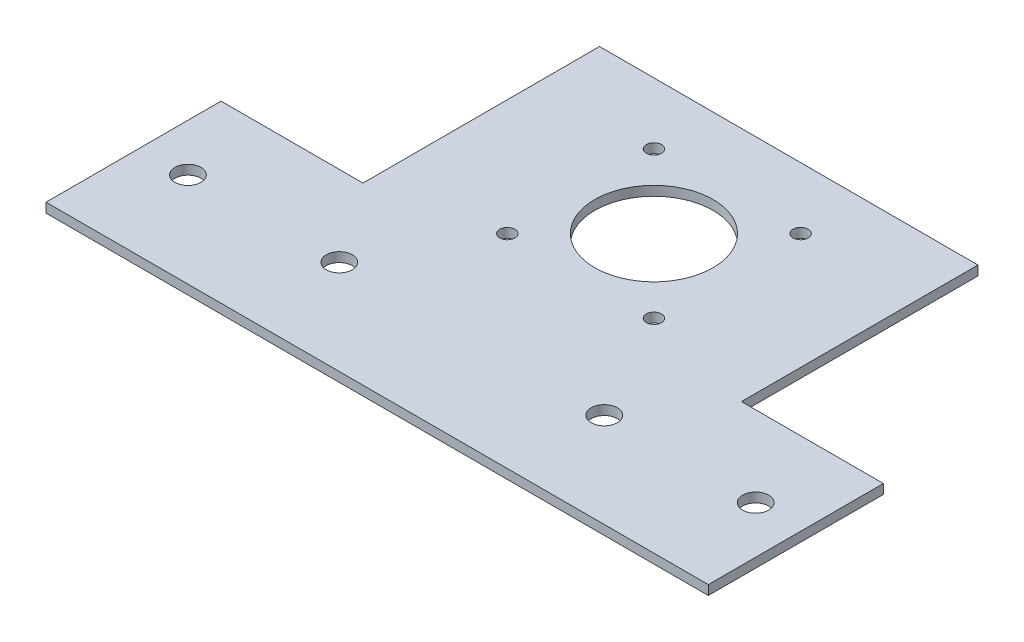
ISO-10303-21;
HEADER;
FILE_DESCRIPTION(('STEP AP214'),'2;1');
FILE_NAME('part.step','',(''),(''),'','','');
FILE_SCHEMA(('AUTOMOTIVE_DESIGN { 1 0 10303 214 1 1 1 1 }'));
ENDSEC;
DATA;
#1=APPLICATION_CONTEXT('core data for automotive mechanical design processes');
#2=APPLICATION_PROTOCOL_DEFINITION('international standard','automotive_design',2000,#1);
#3=PRODUCT_CONTEXT('',#1,'mechanical');
#4=PRODUCT('Part','Part','',(#3));
#5=PRODUCT_RELATED_PRODUCT_CATEGORY('part','',(#4));
#6=PRODUCT_DEFINITION_FORMATION('','',#4);
#7=PRODUCT_DEFINITION_CONTEXT('part definition',#1,'design');
#8=PRODUCT_DEFINITION('design','',#6,#7);
#9=PRODUCT_DEFINITION_SHAPE('','',#8);
#10=(LENGTH_UNIT() NAMED_UNIT(*) SI_UNIT(.MILLI.,.METRE.));
#11=(NAMED_UNIT(*) PLANE_ANGLE_UNIT() SI_UNIT($,.RADIAN.));
#12=(NAMED_UNIT(*) SI_UNIT($,.STERADIAN.) SOLID_ANGLE_UNIT());
#13=UNCERTAINTY_MEASURE_WITH_UNIT(LENGTH_MEASURE(1.E-05),#10,'distance_accuracy_value','');
#14=(GEOMETRIC_REPRESENTATION_CONTEXT(3) GLOBAL_UNCERTAINTY_ASSIGNED_CONTEXT((#13)) GLOBAL_UNIT_ASSIGNED_CONTEXT((#10,
#11,#12)) REPRESENTATION_CONTEXT('',''));
#15=CARTESIAN_POINT('',(0.,0.,0.));
#16=DIRECTION('',(0.,0.,1.));
#17=DIRECTION('',(1.,0.,0.));
#18=AXIS2_PLACEMENT_3D('',#15,#16,#17);
#19=CARTESIAN_POINT('',(0.,2.,0.));
#20=DIRECTION('',(0.,1.,0.));
#21=DIRECTION('',(0.,0.,1.));
#22=AXIS2_PLACEMENT_3D('',#19,#20,#21);
#23=PLANE('',#22);
#24=DIRECTION('',(0.,0.,-1.));
#25=VECTOR('',#24,1.);
#26=CARTESIAN_POINT('',(-40.,2.,-43.5));
#27=LINE('',#26,#25);
#28=CARTESIAN_POINT('',(-40.,2.,6.50000000000001));
#29=VERTEX_POINT('',#28);
#30=CARTESIAN_POINT('',(-40.,2.,-43.5));
#31=VERTEX_POINT('',#30);
#32=EDGE_CURVE('E111',#29,#31,#27,.T.);
#33=ORIENTED_EDGE('',*,*,#32,.F.);
#34=DIRECTION('',(1.,0.,0.));
#35=VECTOR('',#34,1.);
#36=CARTESIAN_POINT('',(-70.,2.,6.50000000000001));
#37=LINE('',#36,#35);
#38=CARTESIAN_POINT('',(-70.,2.,6.50000000000001));
#39=VERTEX_POINT('',#38);
#40=EDGE_CURVE('E100',#39,#29,#37,.T.);
#41=ORIENTED_EDGE('',*,*,#40,.F.);
#42=DIRECTION('',(0.,0.,1.));
#43=VECTOR('',#42,1.);
#44=CARTESIAN_POINT('',(-70.,2.,-43.5));
#45=LINE('',#44,#43);
#46=CARTESIAN_POINT('',(-70.,2.,43.5));
#47=VERTEX_POINT('',#46);
#48=EDGE_CURVE('E108',#39,#47,#45,.T.);
#49=ORIENTED_EDGE('',*,*,#48,.T.);
#50=DIRECTION('',(1.,0.,0.));
#51=VECTOR('',#50,1.);
#52=CARTESIAN_POINT('',(-70.,2.,43.5));
#53=LINE('',#52,#51);
#54=CARTESIAN_POINT('',(70.,2.,43.5));
#55=VERTEX_POINT('',#54);
#56=EDGE_CURVE('E117',#47,#55,#53,.T.);
#57=ORIENTED_EDGE('',*,*,#56,.T.);
#58=DIRECTION('',(0.,0.,-1.));
#59=VECTOR('',#58,1.);
#60=CARTESIAN_POINT('',(70.,2.,-43.5));
#61=LINE('',#60,#59);
#62=CARTESIAN_POINT('',(70.,2.,6.5));
#63=VERTEX_POINT('',#62);
#64=EDGE_CURVE('E122',#55,#63,#61,.T.);
#65=ORIENTED_EDGE('',*,*,#64,.T.);
#66=DIRECTION('',(1.,0.,0.));
#67=VECTOR('',#66,1.);
#68=CARTESIAN_POINT('',(70.,2.,6.5));
#69=LINE('',#68,#67);
#70=CARTESIAN_POINT('',(40.,2.,6.5));
#71=VERTEX_POINT('',#70);
#72=EDGE_CURVE('E217',#71,#63,#69,.T.);
#73=ORIENTED_EDGE('',*,*,#72,.F.);
#74=DIRECTION('',(0.,0.,1.));
#75=VECTOR('',#74,1.);
#76=CARTESIAN_POINT('',(40.,2.,-43.5));
#77=LINE('',#76,#75);
#78=CARTESIAN_POINT('',(40.,2.,-43.5));
#79=VERTEX_POINT('',#78);
#80=EDGE_CURVE('E220',#79,#71,#77,.T.);
#81=ORIENTED_EDGE('',*,*,#80,.F.);
#82=DIRECTION('',(-1.,0.,0.));
#83=VECTOR('',#82,1.);
#84=CARTESIAN_POINT('',(-70.,2.,-43.5));
#85=LINE('',#84,#83);
#86=EDGE_CURVE('E118',#79,#31,#85,.T.);
#87=ORIENTED_EDGE('',*,*,#86,.T.);
#88=EDGE_LOOP('',(#33,#41,#49,#57,#65,#73,#81,#87));
#89=FACE_BOUND('',#88,.T.);
#90=CARTESIAN_POINT('',(15.5000000000003,2.,0.499999999999667));
#91=DIRECTION('',(0.,1.,0.));
#92=DIRECTION('',(0.,0.,1.));
#93=AXIS2_PLACEMENT_3D('',#90,#91,#92);
#94=CIRCLE('',#93,1.6);
#95=CARTESIAN_POINT('',(15.5000000000003,2.,2.09999999999967));
#96=VERTEX_POINT('',#95);
#97=EDGE_CURVE('E194',#96,#96,#94,.T.);
#98=ORIENTED_EDGE('',*,*,#97,.F.);
#99=EDGE_LOOP('',(#98));
#100=FACE_BOUND('',#99,.T.);
#101=CARTESIAN_POINT('',(-15.5,2.,-30.5));
#102=DIRECTION('',(0.,1.,0.));
#103=DIRECTION('',(0.,0.,1.));
#104=AXIS2_PLACEMENT_3D('',#101,#102,#103);
#105=CIRCLE('',#104,1.6);
#106=CARTESIAN_POINT('',(-15.5,2.,-28.9));
#107=VERTEX_POINT('',#106);
#108=EDGE_CURVE('E182',#107,#107,#105,.T.);
#109=ORIENTED_EDGE('',*,*,#108,.F.);
#110=EDGE_LOOP('',(#109));
#111=FACE_BOUND('',#110,.T.);
#112=CARTESIAN_POINT('',(28.,2.,23.5));
#113=DIRECTION('',(0.,1.,0.));
#114=DIRECTION('',(0.,0.,1.));
#115=AXIS2_PLACEMENT_3D('',#112,#113,#114);
#116=CIRCLE('',#115,2.74999999999999);
#117=CARTESIAN_POINT('',(28.,2.,26.25));
#118=VERTEX_POINT('',#117);
#119=EDGE_CURVE('E170',#118,#118,#116,.T.);
#120=ORIENTED_EDGE('',*,*,#119,.F.);
#121=EDGE_LOOP('',(#120));
#122=FACE_BOUND('',#121,.T.);
#123=CARTESIAN_POINT('',(0.,2.,-15.));
#124=DIRECTION('',(0.,1.,0.));
#125=DIRECTION('',(0.,0.,1.));
#126=AXIS2_PLACEMENT_3D('',#123,#124,#125);
#127=CIRCLE('',#126,12.5);
#128=CARTESIAN_POINT('',(0.,2.,-2.50000000000001));
#129=VERTEX_POINT('',#128);
#130=EDGE_CURVE('E158',#129,#129,#127,.T.);
#131=ORIENTED_EDGE('',*,*,#130,.F.);
#132=EDGE_LOOP('',(#131));
#133=FACE_BOUND('',#132,.T.);
#134=CARTESIAN_POINT('',(-60.,2.,23.5));
#135=DIRECTION('',(0.,1.,0.));
#136=DIRECTION('',(0.,0.,1.));
#137=AXIS2_PLACEMENT_3D('',#134,#135,#136);
#138=CIRCLE('',#137,2.75000000000001);
#139=CARTESIAN_POINT('',(-60.,2.,26.25));
#140=VERTEX_POINT('',#139);
#141=EDGE_CURVE('E130',#140,#140,#138,.T.);
#142=ORIENTED_EDGE('',*,*,#141,.F.);
#143=EDGE_LOOP('',(#142));
#144=FACE_BOUND('',#143,.T.);
#145=CARTESIAN_POINT('',(-28.,2.,23.5));
#146=DIRECTION('',(0.,1.,0.));
#147=DIRECTION('',(0.,0.,1.));
#148=AXIS2_PLACEMENT_3D('',#145,#146,#147);
#149=CIRCLE('',#148,2.75);
#150=CARTESIAN_POINT('',(-28.,2.,26.25));
#151=VERTEX_POINT('',#150);
#152=EDGE_CURVE('E164',#151,#151,#149,.T.);
#153=ORIENTED_EDGE('',*,*,#152,.F.);
#154=EDGE_LOOP('',(#153));
#155=FACE_BOUND('',#154,.T.);
#156=CARTESIAN_POINT('',(60.,2.,23.5));
#157=DIRECTION('',(0.,1.,0.));
#158=DIRECTION('',(0.,0.,1.));
#159=AXIS2_PLACEMENT_3D('',#156,#157,#158);
#160=CIRCLE('',#159,2.75000000000001);
#161=CARTESIAN_POINT('',(60.,2.,26.25));
#162=VERTEX_POINT('',#161);
#163=EDGE_CURVE('E176',#162,#162,#160,.T.);
#164=ORIENTED_EDGE('',*,*,#163,.F.);
#165=EDGE_LOOP('',(#164));
#166=FACE_BOUND('',#165,.T.);
#167=CARTESIAN_POINT('',(15.5000000000001,2.,-30.5000000000004));
#168=DIRECTION('',(0.,1.,0.));
#169=DIRECTION('',(0.,0.,1.));
#170=AXIS2_PLACEMENT_3D('',#167,#168,#169);
#171=CIRCLE('',#170,1.6);
#172=CARTESIAN_POINT('',(15.5000000000001,2.,-28.9000000000004));
#173=VERTEX_POINT('',#172);
#174=EDGE_CURVE('E188',#173,#173,#171,.T.);
#175=ORIENTED_EDGE('',*,*,#174,.F.);
#176=EDGE_LOOP('',(#175));
#177=FACE_BOUND('',#176,.T.);
#178=CARTESIAN_POINT('',(-15.4999999999997,2.,0.499999999999832));
#179=DIRECTION('',(0.,1.,0.));
#180=DIRECTION('',(0.,0.,1.));
#181=AXIS2_PLACEMENT_3D('',#178,#179,#180);
#182=CIRCLE('',#181,1.6);
#183=CARTESIAN_POINT('',(-15.4999999999997,2.,2.09999999999983));
#184=VERTEX_POINT('',#183);
#185=EDGE_CURVE('E200',#184,#184,#182,.T.);
#186=ORIENTED_EDGE('',*,*,#185,.F.);
#187=EDGE_LOOP('',(#186));
#188=FACE_BOUND('',#187,.T.);
#189=ADVANCED_FACE('F34',(#89,#100,#111,#122,#133,#144,#155,#166,#177,#188),#23,.T.);
#190=CARTESIAN_POINT('',(0.,0.,0.));
#191=DIRECTION('',(0.,1.,0.));
#192=DIRECTION('',(0.,0.,1.));
#193=AXIS2_PLACEMENT_3D('',#190,#191,#192);
#194=PLANE('',#193);
#195=DIRECTION('',(1.,0.,0.));
#196=VECTOR('',#195,1.);
#197=CARTESIAN_POINT('',(0.,0.,6.50000000000001));
#198=LINE('',#197,#196);
#199=CARTESIAN_POINT('',(-70.,0.,6.50000000000001));
#200=VERTEX_POINT('',#199);
#201=CARTESIAN_POINT('',(-40.,0.,6.50000000000001));
#202=VERTEX_POINT('',#201);
#203=EDGE_CURVE('E56',#200,#202,#198,.T.);
#204=ORIENTED_EDGE('',*,*,#203,.T.);
#205=DIRECTION('',(0.,0.,-1.));
#206=VECTOR('',#205,1.);
#207=CARTESIAN_POINT('',(-40.,0.,0.));
#208=LINE('',#207,#206);
#209=CARTESIAN_POINT('',(-40.,0.,-43.5));
#210=VERTEX_POINT('',#209);
#211=EDGE_CURVE('E209',#202,#210,#208,.T.);
#212=ORIENTED_EDGE('',*,*,#211,.T.);
#213=DIRECTION('',(-1.,0.,0.));
#214=VECTOR('',#213,1.);
#215=CARTESIAN_POINT('',(-70.,0.,-43.5));
#216=LINE('',#215,#214);
#217=CARTESIAN_POINT('',(40.,0.,-43.5));
#218=VERTEX_POINT('',#217);
#219=EDGE_CURVE('E129',#218,#210,#216,.T.);
#220=ORIENTED_EDGE('',*,*,#219,.F.);
#221=DIRECTION('',(0.,0.,1.));
#222=VECTOR('',#221,1.);
#223=CARTESIAN_POINT('',(40.,0.,0.));
#224=LINE('',#223,#222);
#225=CARTESIAN_POINT('',(40.,0.,6.5));
#226=VERTEX_POINT('',#225);
#227=EDGE_CURVE('E49',#218,#226,#224,.T.);
#228=ORIENTED_EDGE('',*,*,#227,.T.);
#229=DIRECTION('',(1.,0.,0.));
#230=VECTOR('',#229,1.);
#231=CARTESIAN_POINT('',(0.,0.,6.50000000000001));
#232=LINE('',#231,#230);
#233=CARTESIAN_POINT('',(70.,0.,6.5));
#234=VERTEX_POINT('',#233);
#235=EDGE_CURVE('E148',#226,#234,#232,.T.);
#236=ORIENTED_EDGE('',*,*,#235,.T.);
#237=DIRECTION('',(0.,0.,-1.));
#238=VECTOR('',#237,1.);
#239=CARTESIAN_POINT('',(70.,0.,-43.5));
#240=LINE('',#239,#238);
#241=CARTESIAN_POINT('',(70.,0.,43.5));
#242=VERTEX_POINT('',#241);
#243=EDGE_CURVE('E126',#242,#234,#240,.T.);
#244=ORIENTED_EDGE('',*,*,#243,.F.);
#245=DIRECTION('',(1.,0.,0.));
#246=VECTOR('',#245,1.);
#247=CARTESIAN_POINT('',(-70.,0.,43.5));
#248=LINE('',#247,#246);
#249=CARTESIAN_POINT('',(-70.,0.,43.5));
#250=VERTEX_POINT('',#249);
#251=EDGE_CURVE('E135',#250,#242,#248,.T.);
#252=ORIENTED_EDGE('',*,*,#251,.F.);
#253=DIRECTION('',(0.,0.,1.));
#254=VECTOR('',#253,1.);
#255=CARTESIAN_POINT('',(-70.,0.,-43.5));
#256=LINE('',#255,#254);
#257=EDGE_CURVE('E133',#200,#250,#256,.T.);
#258=ORIENTED_EDGE('',*,*,#257,.F.);
#259=EDGE_LOOP('',(#204,#212,#220,#228,#236,#244,#252,#258));
#260=FACE_BOUND('',#259,.T.);
#261=CARTESIAN_POINT('',(-60.,0.,23.5));
#262=DIRECTION('',(0.,1.,0.));
#263=DIRECTION('',(0.,0.,1.));
#264=AXIS2_PLACEMENT_3D('',#261,#262,#263);
#265=CIRCLE('',#264,2.75000000000001);
#266=CARTESIAN_POINT('',(-60.,0.,26.25));
#267=VERTEX_POINT('',#266);
#268=EDGE_CURVE('E155',#267,#267,#265,.T.);
#269=ORIENTED_EDGE('',*,*,#268,.T.);
#270=EDGE_LOOP('',(#269));
#271=FACE_BOUND('',#270,.T.);
#272=CARTESIAN_POINT('',(0.,0.,-15.));
#273=DIRECTION('',(0.,1.,0.));
#274=DIRECTION('',(0.,0.,1.));
#275=AXIS2_PLACEMENT_3D('',#272,#273,#274);
#276=CIRCLE('',#275,12.5);
#277=CARTESIAN_POINT('',(0.,0.,-2.50000000000001));
#278=VERTEX_POINT('',#277);
#279=EDGE_CURVE('E161',#278,#278,#276,.T.);
#280=ORIENTED_EDGE('',*,*,#279,.T.);
#281=EDGE_LOOP('',(#280));
#282=FACE_BOUND('',#281,.T.);
#283=CARTESIAN_POINT('',(-28.,0.,23.5));
#284=DIRECTION('',(0.,1.,0.));
#285=DIRECTION('',(0.,0.,1.));
#286=AXIS2_PLACEMENT_3D('',#283,#284,#285);
#287=CIRCLE('',#286,2.75);
#288=CARTESIAN_POINT('',(-28.,0.,26.25));
#289=VERTEX_POINT('',#288);
#290=EDGE_CURVE('E167',#289,#289,#287,.T.);
#291=ORIENTED_EDGE('',*,*,#290,.T.);
#292=EDGE_LOOP('',(#291));
#293=FACE_BOUND('',#292,.T.);
#294=CARTESIAN_POINT('',(28.,0.,23.5));
#295=DIRECTION('',(0.,1.,0.));
#296=DIRECTION('',(0.,0.,1.));
#297=AXIS2_PLACEMENT_3D('',#294,#295,#296);
#298=CIRCLE('',#297,2.74999999999999);
#299=CARTESIAN_POINT('',(28.,0.,26.25));
#300=VERTEX_POINT('',#299);
#301=EDGE_CURVE('E173',#300,#300,#298,.T.);
#302=ORIENTED_EDGE('',*,*,#301,.T.);
#303=EDGE_LOOP('',(#302));
#304=FACE_BOUND('',#303,.T.);
#305=CARTESIAN_POINT('',(60.,0.,23.5));
#306=DIRECTION('',(0.,1.,0.));
#307=DIRECTION('',(0.,0.,1.));
#308=AXIS2_PLACEMENT_3D('',#305,#306,#307);
#309=CIRCLE('',#308,2.75000000000001);
#310=CARTESIAN_POINT('',(60.,0.,26.25));
#311=VERTEX_POINT('',#310);
#312=EDGE_CURVE('E179',#311,#311,#309,.T.);
#313=ORIENTED_EDGE('',*,*,#312,.T.);
#314=EDGE_LOOP('',(#313));
#315=FACE_BOUND('',#314,.T.);
#316=CARTESIAN_POINT('',(-15.5,0.,-30.5));
#317=DIRECTION('',(0.,1.,0.));
#318=DIRECTION('',(0.,0.,1.));
#319=AXIS2_PLACEMENT_3D('',#316,#317,#318);
#320=CIRCLE('',#319,1.6);
#321=CARTESIAN_POINT('',(-15.5,0.,-28.9));
#322=VERTEX_POINT('',#321);
#323=EDGE_CURVE('E185',#322,#322,#320,.T.);
#324=ORIENTED_EDGE('',*,*,#323,.T.);
#325=EDGE_LOOP('',(#324));
#326=FACE_BOUND('',#325,.T.);
#327=CARTESIAN_POINT('',(15.5000000000001,0.,-30.5000000000004));
#328=DIRECTION('',(0.,1.,0.));
#329=DIRECTION('',(0.,0.,1.));
#330=AXIS2_PLACEMENT_3D('',#327,#328,#329);
#331=CIRCLE('',#330,1.6);
#332=CARTESIAN_POINT('',(15.5000000000001,0.,-28.9000000000004));
#333=VERTEX_POINT('',#332);
#334=EDGE_CURVE('E191',#333,#333,#331,.T.);
#335=ORIENTED_EDGE('',*,*,#334,.T.);
#336=EDGE_LOOP('',(#335));
#337=FACE_BOUND('',#336,.T.);
#338=CARTESIAN_POINT('',(15.5000000000003,0.,0.499999999999667));
#339=DIRECTION('',(0.,1.,0.));
#340=DIRECTION('',(0.,0.,1.));
#341=AXIS2_PLACEMENT_3D('',#338,#339,#340);
#342=CIRCLE('',#341,1.6);
#343=CARTESIAN_POINT('',(15.5000000000003,0.,2.09999999999967));
#344=VERTEX_POINT('',#343);
#345=EDGE_CURVE('E197',#344,#344,#342,.T.);
#346=ORIENTED_EDGE('',*,*,#345,.T.);
#347=EDGE_LOOP('',(#346));
#348=FACE_BOUND('',#347,.T.);
#349=CARTESIAN_POINT('',(-15.4999999999997,0.,0.499999999999832));
#350=DIRECTION('',(0.,1.,0.));
#351=DIRECTION('',(0.,0.,1.));
#352=AXIS2_PLACEMENT_3D('',#349,#350,#351);
#353=CIRCLE('',#352,1.6);
#354=CARTESIAN_POINT('',(-15.4999999999997,0.,2.09999999999983));
#355=VERTEX_POINT('',#354);
#356=EDGE_CURVE('E203',#355,#355,#353,.T.);
#357=ORIENTED_EDGE('',*,*,#356,.T.);
#358=EDGE_LOOP('',(#357));
#359=FACE_BOUND('',#358,.T.);
#360=ADVANCED_FACE('F145',(#260,#271,#282,#293,#304,#315,#326,#337,#348,#359),#194,.F.);
#361=CARTESIAN_POINT('',(70.,2.,-43.5));
#362=DIRECTION('',(-1.,0.,0.));
#363=DIRECTION('',(0.,0.,1.));
#364=AXIS2_PLACEMENT_3D('',#361,#362,#363);
#365=PLANE('',#364);
#366=ORIENTED_EDGE('',*,*,#243,.T.);
#367=DIRECTION('',(0.,1.,0.));
#368=VECTOR('',#367,1.);
#369=CARTESIAN_POINT('',(70.,-8.,6.5));
#370=LINE('',#369,#368);
#371=EDGE_CURVE('E112',#234,#63,#370,.T.);
#372=ORIENTED_EDGE('',*,*,#371,.T.);
#373=ORIENTED_EDGE('',*,*,#64,.F.);
#374=DIRECTION('',(0.,-1.,0.));
#375=VECTOR('',#374,1.);
#376=CARTESIAN_POINT('',(70.,2.,43.5));
#377=LINE('',#376,#375);
#378=EDGE_CURVE('E120',#55,#242,#377,.T.);
#379=ORIENTED_EDGE('',*,*,#378,.T.);
#380=EDGE_LOOP('',(#366,#372,#373,#379));
#381=FACE_BOUND('',#380,.T.);
#382=ADVANCED_FACE('F36',(#381),#365,.F.);
#383=CARTESIAN_POINT('',(-70.,2.,-43.5));
#384=DIRECTION('',(0.,0.,1.));
#385=DIRECTION('',(1.,0.,0.));
#386=AXIS2_PLACEMENT_3D('',#383,#384,#385);
#387=PLANE('',#386);
#388=ORIENTED_EDGE('',*,*,#219,.T.);
#389=DIRECTION('',(0.,1.,0.));
#390=VECTOR('',#389,1.);
#391=CARTESIAN_POINT('',(-40.,-8.,-43.5));
#392=LINE('',#391,#390);
#393=EDGE_CURVE('E214',#210,#31,#392,.T.);
#394=ORIENTED_EDGE('',*,*,#393,.T.);
#395=ORIENTED_EDGE('',*,*,#86,.F.);
#396=DIRECTION('',(0.,-1.,0.));
#397=VECTOR('',#396,1.);
#398=CARTESIAN_POINT('',(40.,2.,-43.5));
#399=LINE('',#398,#397);
#400=EDGE_CURVE('E11',#79,#218,#399,.T.);
#401=ORIENTED_EDGE('',*,*,#400,.T.);
#402=EDGE_LOOP('',(#388,#394,#395,#401));
#403=FACE_BOUND('',#402,.T.);
#404=ADVANCED_FACE('F231',(#403),#387,.F.);
#405=CARTESIAN_POINT('',(-70.,2.,-43.5));
#406=DIRECTION('',(1.,0.,0.));
#407=DIRECTION('',(0.,0.,-1.));
#408=AXIS2_PLACEMENT_3D('',#405,#406,#407);
#409=PLANE('',#408);
#410=ORIENTED_EDGE('',*,*,#48,.F.);
#411=DIRECTION('',(0.,-1.,0.));
#412=VECTOR('',#411,1.);
#413=CARTESIAN_POINT('',(-70.,2.,6.50000000000001));
#414=LINE('',#413,#412);
#415=EDGE_CURVE('E42',#39,#200,#414,.T.);
#416=ORIENTED_EDGE('',*,*,#415,.T.);
#417=ORIENTED_EDGE('',*,*,#257,.T.);
#418=DIRECTION('',(0.,-1.,0.));
#419=VECTOR('',#418,1.);
#420=CARTESIAN_POINT('',(-70.,2.,43.5));
#421=LINE('',#420,#419);
#422=EDGE_CURVE('E105',#47,#250,#421,.T.);
#423=ORIENTED_EDGE('',*,*,#422,.F.);
#424=EDGE_LOOP('',(#410,#416,#417,#423));
#425=FACE_BOUND('',#424,.T.);
#426=ADVANCED_FACE('F114',(#425),#409,.F.);
#427=CARTESIAN_POINT('',(-70.,2.,43.5));
#428=DIRECTION('',(0.,0.,-1.));
#429=DIRECTION('',(-1.,0.,0.));
#430=AXIS2_PLACEMENT_3D('',#427,#428,#429);
#431=PLANE('',#430);
#432=ORIENTED_EDGE('',*,*,#251,.T.);
#433=ORIENTED_EDGE('',*,*,#378,.F.);
#434=ORIENTED_EDGE('',*,*,#56,.F.);
#435=ORIENTED_EDGE('',*,*,#422,.T.);
#436=EDGE_LOOP('',(#432,#433,#434,#435));
#437=FACE_BOUND('',#436,.T.);
#438=ADVANCED_FACE('F141',(#437),#431,.F.);
#439=CARTESIAN_POINT('',(-60.,2.,23.5));
#440=DIRECTION('',(0.,-1.,0.));
#441=DIRECTION('',(0.,0.,-1.));
#442=AXIS2_PLACEMENT_3D('',#439,#440,#441);
#443=CYLINDRICAL_SURFACE('',#442,2.75000000000001);
#444=ORIENTED_EDGE('',*,*,#141,.T.);
#445=EDGE_LOOP('',(#444));
#446=FACE_BOUND('',#445,.T.);
#447=ORIENTED_EDGE('',*,*,#268,.F.);
#448=EDGE_LOOP('',(#447));
#449=FACE_BOUND('',#448,.T.);
#450=ADVANCED_FACE('F252',(#446,#449),#443,.F.);
#451=CARTESIAN_POINT('',(0.,2.,-15.));
#452=DIRECTION('',(0.,-1.,0.));
#453=DIRECTION('',(0.,0.,-1.));
#454=AXIS2_PLACEMENT_3D('',#451,#452,#453);
#455=CYLINDRICAL_SURFACE('',#454,12.5);
#456=ORIENTED_EDGE('',*,*,#130,.T.);
#457=EDGE_LOOP('',(#456));
#458=FACE_BOUND('',#457,.T.);
#459=ORIENTED_EDGE('',*,*,#279,.F.);
#460=EDGE_LOOP('',(#459));
#461=FACE_BOUND('',#460,.T.);
#462=ADVANCED_FACE('F346',(#458,#461),#455,.F.);
#463=CARTESIAN_POINT('',(-28.,2.,23.5));
#464=DIRECTION('',(0.,-1.,0.));
#465=DIRECTION('',(0.,0.,-1.));
#466=AXIS2_PLACEMENT_3D('',#463,#464,#465);
#467=CYLINDRICAL_SURFACE('',#466,2.75);
#468=ORIENTED_EDGE('',*,*,#152,.T.);
#469=EDGE_LOOP('',(#468));
#470=FACE_BOUND('',#469,.T.);
#471=ORIENTED_EDGE('',*,*,#290,.F.);
#472=EDGE_LOOP('',(#471));
#473=FACE_BOUND('',#472,.T.);
#474=ADVANCED_FACE('F336',(#470,#473),#467,.F.);
#475=CARTESIAN_POINT('',(28.,2.,23.5));
#476=DIRECTION('',(0.,-1.,0.));
#477=DIRECTION('',(0.,0.,-1.));
#478=AXIS2_PLACEMENT_3D('',#475,#476,#477);
#479=CYLINDRICAL_SURFACE('',#478,2.74999999999999);
#480=ORIENTED_EDGE('',*,*,#119,.T.);
#481=EDGE_LOOP('',(#480));
#482=FACE_BOUND('',#481,.T.);
#483=ORIENTED_EDGE('',*,*,#301,.F.);
#484=EDGE_LOOP('',(#483));
#485=FACE_BOUND('',#484,.T.);
#486=ADVANCED_FACE('F326',(#482,#485),#479,.F.);
#487=CARTESIAN_POINT('',(60.,2.,23.5));
#488=DIRECTION('',(0.,-1.,0.));
#489=DIRECTION('',(0.,0.,-1.));
#490=AXIS2_PLACEMENT_3D('',#487,#488,#489);
#491=CYLINDRICAL_SURFACE('',#490,2.75000000000001);
#492=ORIENTED_EDGE('',*,*,#163,.T.);
#493=EDGE_LOOP('',(#492));
#494=FACE_BOUND('',#493,.T.);
#495=ORIENTED_EDGE('',*,*,#312,.F.);
#496=EDGE_LOOP('',(#495));
#497=FACE_BOUND('',#496,.T.);
#498=ADVANCED_FACE('F316',(#494,#497),#491,.F.);
#499=CARTESIAN_POINT('',(-15.5,2.,-30.5));
#500=DIRECTION('',(0.,-1.,0.));
#501=DIRECTION('',(0.,0.,-1.));
#502=AXIS2_PLACEMENT_3D('',#499,#500,#501);
#503=CYLINDRICAL_SURFACE('',#502,1.6);
#504=ORIENTED_EDGE('',*,*,#108,.T.);
#505=EDGE_LOOP('',(#504));
#506=FACE_BOUND('',#505,.T.);
#507=ORIENTED_EDGE('',*,*,#323,.F.);
#508=EDGE_LOOP('',(#507));
#509=FACE_BOUND('',#508,.T.);
#510=ADVANCED_FACE('F306',(#506,#509),#503,.F.);
#511=CARTESIAN_POINT('',(15.5000000000001,2.,-30.5000000000004));
#512=DIRECTION('',(0.,-1.,0.));
#513=DIRECTION('',(0.,0.,-1.));
#514=AXIS2_PLACEMENT_3D('',#511,#512,#513);
#515=CYLINDRICAL_SURFACE('',#514,1.6);
#516=ORIENTED_EDGE('',*,*,#174,.T.);
#517=EDGE_LOOP('',(#516));
#518=FACE_BOUND('',#517,.T.);
#519=ORIENTED_EDGE('',*,*,#334,.F.);
#520=EDGE_LOOP('',(#519));
#521=FACE_BOUND('',#520,.T.);
#522=ADVANCED_FACE('F296',(#518,#521),#515,.F.);
#523=CARTESIAN_POINT('',(15.5000000000003,2.,0.499999999999667));
#524=DIRECTION('',(0.,-1.,0.));
#525=DIRECTION('',(0.,0.,-1.));
#526=AXIS2_PLACEMENT_3D('',#523,#524,#525);
#527=CYLINDRICAL_SURFACE('',#526,1.6);
#528=ORIENTED_EDGE('',*,*,#97,.T.);
#529=EDGE_LOOP('',(#528));
#530=FACE_BOUND('',#529,.T.);
#531=ORIENTED_EDGE('',*,*,#345,.F.);
#532=EDGE_LOOP('',(#531));
#533=FACE_BOUND('',#532,.T.);
#534=ADVANCED_FACE('F284',(#530,#533),#527,.F.);
#535=CARTESIAN_POINT('',(-15.4999999999997,2.,0.499999999999832));
#536=DIRECTION('',(0.,-1.,0.));
#537=DIRECTION('',(0.,0.,-1.));
#538=AXIS2_PLACEMENT_3D('',#535,#536,#537);
#539=CYLINDRICAL_SURFACE('',#538,1.6);
#540=ORIENTED_EDGE('',*,*,#185,.T.);
#541=EDGE_LOOP('',(#540));
#542=FACE_BOUND('',#541,.T.);
#543=ORIENTED_EDGE('',*,*,#356,.F.);
#544=EDGE_LOOP('',(#543));
#545=FACE_BOUND('',#544,.T.);
#546=ADVANCED_FACE('F279',(#542,#545),#539,.F.);
#547=CARTESIAN_POINT('',(-40.,-8.,-43.5));
#548=DIRECTION('',(1.,0.,0.));
#549=DIRECTION('',(0.,0.,-1.));
#550=AXIS2_PLACEMENT_3D('',#547,#548,#549);
#551=PLANE('',#550);
#552=DIRECTION('',(0.,1.,0.));
#553=VECTOR('',#552,1.);
#554=CARTESIAN_POINT('',(-40.,-8.,6.50000000000001));
#555=LINE('',#554,#553);
#556=EDGE_CURVE('E223',#202,#29,#555,.T.);
#557=ORIENTED_EDGE('',*,*,#556,.T.);
#558=ORIENTED_EDGE('',*,*,#32,.T.);
#559=ORIENTED_EDGE('',*,*,#393,.F.);
#560=ORIENTED_EDGE('',*,*,#211,.F.);
#561=EDGE_LOOP('',(#557,#558,#559,#560));
#562=FACE_BOUND('',#561,.T.);
#563=ADVANCED_FACE('F228',(#562),#551,.F.);
#564=CARTESIAN_POINT('',(-70.,-8.,6.50000000000001));
#565=DIRECTION('',(0.,0.,1.));
#566=DIRECTION('',(1.,0.,0.));
#567=AXIS2_PLACEMENT_3D('',#564,#565,#566);
#568=PLANE('',#567);
#569=ORIENTED_EDGE('',*,*,#415,.F.);
#570=ORIENTED_EDGE('',*,*,#40,.T.);
#571=ORIENTED_EDGE('',*,*,#556,.F.);
#572=ORIENTED_EDGE('',*,*,#203,.F.);
#573=EDGE_LOOP('',(#569,#570,#571,#572));
#574=FACE_BOUND('',#573,.T.);
#575=ADVANCED_FACE('F99',(#574),#568,.F.);
#576=CARTESIAN_POINT('',(70.,-8.,6.5));
#577=DIRECTION('',(0.,0.,1.));
#578=DIRECTION('',(1.,0.,0.));
#579=AXIS2_PLACEMENT_3D('',#576,#577,#578);
#580=PLANE('',#579);
#581=DIRECTION('',(0.,1.,0.));
#582=VECTOR('',#581,1.);
#583=CARTESIAN_POINT('',(40.,-8.,6.5));
#584=LINE('',#583,#582);
#585=EDGE_CURVE('E215',#226,#71,#584,.T.);
#586=ORIENTED_EDGE('',*,*,#585,.T.);
#587=ORIENTED_EDGE('',*,*,#72,.T.);
#588=ORIENTED_EDGE('',*,*,#371,.F.);
#589=ORIENTED_EDGE('',*,*,#235,.F.);
#590=EDGE_LOOP('',(#586,#587,#588,#589));
#591=FACE_BOUND('',#590,.T.);
#592=ADVANCED_FACE('F236',(#591),#580,.F.);
#593=CARTESIAN_POINT('',(40.,-8.,-43.5));
#594=DIRECTION('',(-1.,0.,0.));
#595=DIRECTION('',(0.,0.,1.));
#596=AXIS2_PLACEMENT_3D('',#593,#594,#595);
#597=PLANE('',#596);
#598=ORIENTED_EDGE('',*,*,#400,.F.);
#599=ORIENTED_EDGE('',*,*,#80,.T.);
#600=ORIENTED_EDGE('',*,*,#585,.F.);
#601=ORIENTED_EDGE('',*,*,#227,.F.);
#602=EDGE_LOOP('',(#598,#599,#600,#601));
#603=FACE_BOUND('',#602,.T.);
#604=ADVANCED_FACE('F234',(#603),#597,.F.);
#605=CLOSED_SHELL('',(#189,#360,#382,#404,#426,#438,#450,#462,#474,#486,#498,#510,#522,#534,
#546,#563,#575,#592,#604));
#606=MANIFOLD_SOLID_BREP('B2',#605);
#607=ADVANCED_BREP_SHAPE_REPRESENTATION('',(#18,#606),#14);
#608=SHAPE_DEFINITION_REPRESENTATION(#9,#607);
ENDSEC;
END-ISO-10303-21;
